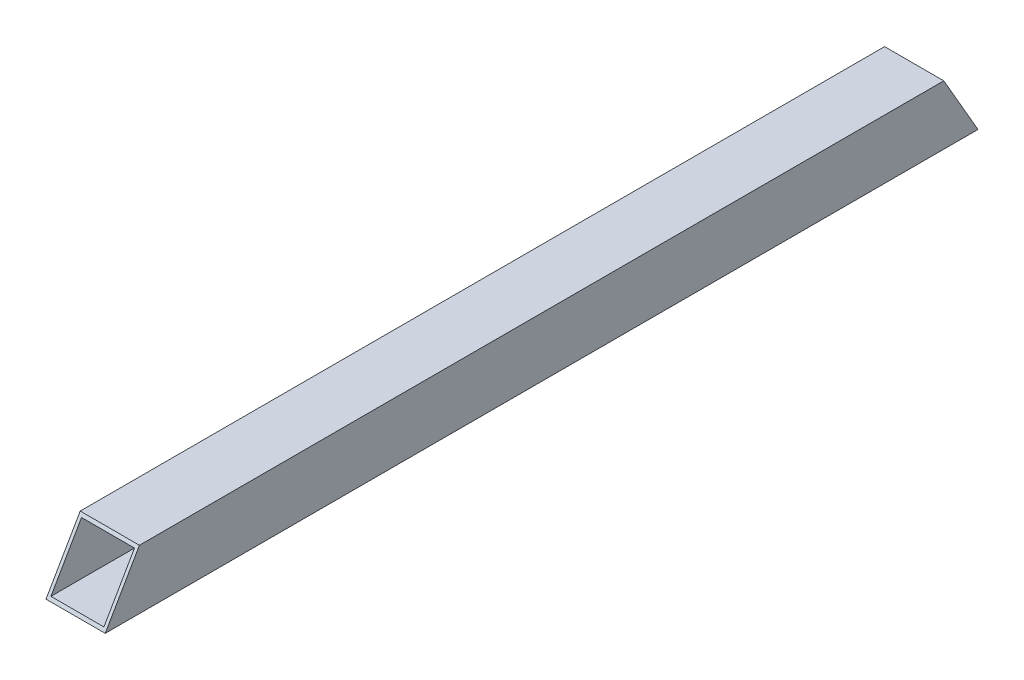
ISO-10303-21;
HEADER;
FILE_DESCRIPTION(('STEP AP214'),'2;1');
FILE_NAME('part.step','',(''),(''),'','','');
FILE_SCHEMA(('AUTOMOTIVE_DESIGN { 1 0 10303 214 1 1 1 1 }'));
ENDSEC;
DATA;
#1=APPLICATION_CONTEXT('core data for automotive mechanical design processes');
#2=APPLICATION_PROTOCOL_DEFINITION('international standard','automotive_design',2000,#1);
#3=PRODUCT_CONTEXT('',#1,'mechanical');
#4=PRODUCT('Part','Part','',(#3));
#5=PRODUCT_RELATED_PRODUCT_CATEGORY('part','',(#4));
#6=PRODUCT_DEFINITION_FORMATION('','',#4);
#7=PRODUCT_DEFINITION_CONTEXT('part definition',#1,'design');
#8=PRODUCT_DEFINITION('design','',#6,#7);
#9=PRODUCT_DEFINITION_SHAPE('','',#8);
#10=(LENGTH_UNIT() NAMED_UNIT(*) SI_UNIT(.MILLI.,.METRE.));
#11=(NAMED_UNIT(*) PLANE_ANGLE_UNIT() SI_UNIT($,.RADIAN.));
#12=(NAMED_UNIT(*) SI_UNIT($,.STERADIAN.) SOLID_ANGLE_UNIT());
#13=UNCERTAINTY_MEASURE_WITH_UNIT(LENGTH_MEASURE(1.E-05),#10,'distance_accuracy_value','');
#14=(GEOMETRIC_REPRESENTATION_CONTEXT(3) GLOBAL_UNCERTAINTY_ASSIGNED_CONTEXT((#13)) GLOBAL_UNIT_ASSIGNED_CONTEXT((#10,
#11,#12)) REPRESENTATION_CONTEXT('',''));
#15=CARTESIAN_POINT('',(0.,0.,0.));
#16=DIRECTION('',(0.,0.,1.));
#17=DIRECTION('',(1.,0.,0.));
#18=AXIS2_PLACEMENT_3D('',#15,#16,#17);
#19=CARTESIAN_POINT('',(9.5,-9.5,280.));
#20=DIRECTION('',(-1.,0.,0.));
#21=DIRECTION('',(0.,0.,1.));
#22=AXIS2_PLACEMENT_3D('',#19,#20,#21);
#23=PLANE('',#22);
#24=DIRECTION('',(0.,0.,-1.));
#25=VECTOR('',#24,1.);
#26=CARTESIAN_POINT('',(9.5,-9.5,280.));
#27=LINE('',#26,#25);
#28=CARTESIAN_POINT('',(9.50000000000001,-9.5,280.));
#29=VERTEX_POINT('',#28);
#30=CARTESIAN_POINT('',(9.5,-9.5,0.));
#31=VERTEX_POINT('',#30);
#32=EDGE_CURVE('E120',#29,#31,#27,.T.);
#33=ORIENTED_EDGE('',*,*,#32,.T.);
#34=DIRECTION('',(0.,0.866025403784436,0.500000000000004));
#35=VECTOR('',#34,1.);
#36=CARTESIAN_POINT('',(9.5,111.743556529822,70.0000000000012));
#37=LINE('',#36,#35);
#38=CARTESIAN_POINT('',(9.50000000000001,9.5,10.969655114603));
#39=VERTEX_POINT('',#38);
#40=EDGE_CURVE('E105',#31,#39,#37,.T.);
#41=ORIENTED_EDGE('',*,*,#40,.T.);
#42=DIRECTION('',(0.,0.,-1.));
#43=VECTOR('',#42,1.);
#44=CARTESIAN_POINT('',(9.5,9.5,280.));
#45=LINE('',#44,#43);
#46=CARTESIAN_POINT('',(9.5,9.5,269.030344885397));
#47=VERTEX_POINT('',#46);
#48=EDGE_CURVE('E43',#47,#39,#45,.T.);
#49=ORIENTED_EDGE('',*,*,#48,.F.);
#50=DIRECTION('',(0.,0.866025403784442,-0.499999999999995));
#51=VECTOR('',#50,1.);
#52=CARTESIAN_POINT('',(9.5,-9.5,280.));
#53=LINE('',#52,#51);
#54=EDGE_CURVE('E145',#29,#47,#53,.T.);
#55=ORIENTED_EDGE('',*,*,#54,.F.);
#56=EDGE_LOOP('',(#33,#41,#49,#55));
#57=FACE_BOUND('',#56,.T.);
#58=ADVANCED_FACE('F36',(#57),#23,.F.);
#59=CARTESIAN_POINT('',(-9.5,9.5,280.));
#60=DIRECTION('',(0.,-1.,0.));
#61=DIRECTION('',(0.,0.,-1.));
#62=AXIS2_PLACEMENT_3D('',#59,#60,#61);
#63=PLANE('',#62);
#64=ORIENTED_EDGE('',*,*,#48,.T.);
#65=DIRECTION('',(-1.,0.,0.));
#66=VECTOR('',#65,1.);
#67=CARTESIAN_POINT('',(361.107913733465,9.5,10.969655114603));
#68=LINE('',#67,#66);
#69=CARTESIAN_POINT('',(-9.50000000000001,9.5,10.969655114603));
#70=VERTEX_POINT('',#69);
#71=EDGE_CURVE('E102',#39,#70,#68,.T.);
#72=ORIENTED_EDGE('',*,*,#71,.T.);
#73=DIRECTION('',(0.,0.,-1.));
#74=VECTOR('',#73,1.);
#75=CARTESIAN_POINT('',(-9.5,9.5,280.));
#76=LINE('',#75,#74);
#77=CARTESIAN_POINT('',(-9.5,9.5,269.030344885397));
#78=VERTEX_POINT('',#77);
#79=EDGE_CURVE('E125',#78,#70,#76,.T.);
#80=ORIENTED_EDGE('',*,*,#79,.F.);
#81=DIRECTION('',(-1.,0.,0.));
#82=VECTOR('',#81,1.);
#83=CARTESIAN_POINT('',(361.107913733465,9.5,269.030344885397));
#84=LINE('',#83,#82);
#85=EDGE_CURVE('E121',#47,#78,#84,.T.);
#86=ORIENTED_EDGE('',*,*,#85,.F.);
#87=EDGE_LOOP('',(#64,#72,#80,#86));
#88=FACE_BOUND('',#87,.T.);
#89=ADVANCED_FACE('F123',(#88),#63,.F.);
#90=CARTESIAN_POINT('',(-9.5,-9.5,280.));
#91=DIRECTION('',(1.,0.,0.));
#92=DIRECTION('',(0.,0.,-1.));
#93=AXIS2_PLACEMENT_3D('',#90,#91,#92);
#94=PLANE('',#93);
#95=ORIENTED_EDGE('',*,*,#79,.T.);
#96=DIRECTION('',(0.,-0.866025403784436,-0.500000000000004));
#97=VECTOR('',#96,1.);
#98=CARTESIAN_POINT('',(-9.5,111.743556529822,70.0000000000012));
#99=LINE('',#98,#97);
#100=CARTESIAN_POINT('',(-9.50000000000001,-9.5,0.));
#101=VERTEX_POINT('',#100);
#102=EDGE_CURVE('E108',#70,#101,#99,.T.);
#103=ORIENTED_EDGE('',*,*,#102,.T.);
#104=DIRECTION('',(0.,0.,-1.));
#105=VECTOR('',#104,1.);
#106=CARTESIAN_POINT('',(-9.5,-9.5,280.));
#107=LINE('',#106,#105);
#108=CARTESIAN_POINT('',(-9.5,-9.5,280.));
#109=VERTEX_POINT('',#108);
#110=EDGE_CURVE('E126',#109,#101,#107,.T.);
#111=ORIENTED_EDGE('',*,*,#110,.F.);
#112=DIRECTION('',(0.,-0.866025403784442,0.499999999999995));
#113=VECTOR('',#112,1.);
#114=CARTESIAN_POINT('',(-9.5,-9.5,280.));
#115=LINE('',#114,#113);
#116=EDGE_CURVE('E147',#78,#109,#115,.T.);
#117=ORIENTED_EDGE('',*,*,#116,.F.);
#118=EDGE_LOOP('',(#95,#103,#111,#117));
#119=FACE_BOUND('',#118,.T.);
#120=ADVANCED_FACE('F181',(#119),#94,.F.);
#121=CARTESIAN_POINT('',(-8.5,-8.5,280.));
#122=DIRECTION('',(1.,0.,0.));
#123=DIRECTION('',(0.,0.,-1.));
#124=AXIS2_PLACEMENT_3D('',#121,#122,#123);
#125=PLANE('',#124);
#126=DIRECTION('',(0.,-0.866025403784436,-0.500000000000004));
#127=VECTOR('',#126,1.);
#128=CARTESIAN_POINT('',(-8.5,112.493556529822,70.4330127018934));
#129=LINE('',#128,#127);
#130=CARTESIAN_POINT('',(-8.5,8.5,10.3923048454134));
#131=VERTEX_POINT('',#130);
#132=CARTESIAN_POINT('',(-8.5,-8.5,0.577350269189592));
#133=VERTEX_POINT('',#132);
#134=EDGE_CURVE('E161',#131,#133,#129,.T.);
#135=ORIENTED_EDGE('',*,*,#134,.F.);
#136=DIRECTION('',(0.,0.,-1.));
#137=VECTOR('',#136,1.);
#138=CARTESIAN_POINT('',(-8.5,8.5,280.));
#139=LINE('',#138,#137);
#140=CARTESIAN_POINT('',(-8.5,8.5,269.607695154587));
#141=VERTEX_POINT('',#140);
#142=EDGE_CURVE('E143',#141,#131,#139,.T.);
#143=ORIENTED_EDGE('',*,*,#142,.F.);
#144=DIRECTION('',(0.,-0.866025403784442,0.499999999999995));
#145=VECTOR('',#144,1.);
#146=CARTESIAN_POINT('',(-8.5,-8.74999999999999,279.566987298108));
#147=LINE('',#146,#145);
#148=CARTESIAN_POINT('',(-8.5,-8.5,279.42264973081));
#149=VERTEX_POINT('',#148);
#150=EDGE_CURVE('E150',#141,#149,#147,.T.);
#151=ORIENTED_EDGE('',*,*,#150,.T.);
#152=DIRECTION('',(0.,0.,-1.));
#153=VECTOR('',#152,1.);
#154=CARTESIAN_POINT('',(-8.5,-8.5,280.));
#155=LINE('',#154,#153);
#156=EDGE_CURVE('E135',#149,#133,#155,.T.);
#157=ORIENTED_EDGE('',*,*,#156,.T.);
#158=EDGE_LOOP('',(#135,#143,#151,#157));
#159=FACE_BOUND('',#158,.T.);
#160=ADVANCED_FACE('F179',(#159),#125,.T.);
#161=CARTESIAN_POINT('',(-8.5,-8.5,280.));
#162=DIRECTION('',(0.,1.,0.));
#163=DIRECTION('',(0.,0.,1.));
#164=AXIS2_PLACEMENT_3D('',#161,#162,#163);
#165=PLANE('',#164);
#166=DIRECTION('',(1.,0.,0.));
#167=VECTOR('',#166,1.);
#168=CARTESIAN_POINT('',(-8.5,-8.5,0.577350269189592));
#169=LINE('',#168,#167);
#170=CARTESIAN_POINT('',(8.5,-8.50000000000001,0.577350269189592));
#171=VERTEX_POINT('',#170);
#172=EDGE_CURVE('E50',#133,#171,#169,.T.);
#173=ORIENTED_EDGE('',*,*,#172,.F.);
#174=ORIENTED_EDGE('',*,*,#156,.F.);
#175=DIRECTION('',(1.,0.,0.));
#176=VECTOR('',#175,1.);
#177=CARTESIAN_POINT('',(-8.5,-8.5,279.42264973081));
#178=LINE('',#177,#176);
#179=CARTESIAN_POINT('',(8.5,-8.5,279.42264973081));
#180=VERTEX_POINT('',#179);
#181=EDGE_CURVE('E153',#149,#180,#178,.T.);
#182=ORIENTED_EDGE('',*,*,#181,.T.);
#183=DIRECTION('',(0.,0.,-1.));
#184=VECTOR('',#183,1.);
#185=CARTESIAN_POINT('',(8.5,-8.5,280.));
#186=LINE('',#185,#184);
#187=EDGE_CURVE('E139',#180,#171,#186,.T.);
#188=ORIENTED_EDGE('',*,*,#187,.T.);
#189=EDGE_LOOP('',(#173,#174,#182,#188));
#190=FACE_BOUND('',#189,.T.);
#191=ADVANCED_FACE('F177',(#190),#165,.T.);
#192=CARTESIAN_POINT('',(8.5,-8.5,280.));
#193=DIRECTION('',(-1.,0.,0.));
#194=DIRECTION('',(0.,-1.,0.));
#195=AXIS2_PLACEMENT_3D('',#192,#193,#194);
#196=PLANE('',#195);
#197=DIRECTION('',(0.,0.866025403784436,0.500000000000004));
#198=VECTOR('',#197,1.);
#199=CARTESIAN_POINT('',(8.49999999999999,112.493556529822,70.4330127018934));
#200=LINE('',#199,#198);
#201=CARTESIAN_POINT('',(8.5,8.5,10.3923048454134));
#202=VERTEX_POINT('',#201);
#203=EDGE_CURVE('E58',#171,#202,#200,.T.);
#204=ORIENTED_EDGE('',*,*,#203,.F.);
#205=ORIENTED_EDGE('',*,*,#187,.F.);
#206=DIRECTION('',(0.,0.866025403784442,-0.499999999999995));
#207=VECTOR('',#206,1.);
#208=CARTESIAN_POINT('',(8.5,-8.74999999999999,279.566987298108));
#209=LINE('',#208,#207);
#210=CARTESIAN_POINT('',(8.5,8.5,269.607695154587));
#211=VERTEX_POINT('',#210);
#212=EDGE_CURVE('E156',#180,#211,#209,.T.);
#213=ORIENTED_EDGE('',*,*,#212,.T.);
#214=DIRECTION('',(0.,0.,-1.));
#215=VECTOR('',#214,1.);
#216=CARTESIAN_POINT('',(8.5,8.5,280.));
#217=LINE('',#216,#215);
#218=EDGE_CURVE('E141',#211,#202,#217,.T.);
#219=ORIENTED_EDGE('',*,*,#218,.T.);
#220=EDGE_LOOP('',(#204,#205,#213,#219));
#221=FACE_BOUND('',#220,.T.);
#222=ADVANCED_FACE('F173',(#221),#196,.T.);
#223=CARTESIAN_POINT('',(-8.5,8.5,280.));
#224=DIRECTION('',(0.,-1.,0.));
#225=DIRECTION('',(0.,0.,-1.));
#226=AXIS2_PLACEMENT_3D('',#223,#224,#225);
#227=PLANE('',#226);
#228=DIRECTION('',(-1.,0.,0.));
#229=VECTOR('',#228,1.);
#230=CARTESIAN_POINT('',(-8.5,8.5,10.3923048454134));
#231=LINE('',#230,#229);
#232=EDGE_CURVE('E113',#202,#131,#231,.T.);
#233=ORIENTED_EDGE('',*,*,#232,.F.);
#234=ORIENTED_EDGE('',*,*,#218,.F.);
#235=DIRECTION('',(-1.,0.,0.));
#236=VECTOR('',#235,1.);
#237=CARTESIAN_POINT('',(-8.5,8.5,269.607695154587));
#238=LINE('',#237,#236);
#239=EDGE_CURVE('E11',#211,#141,#238,.T.);
#240=ORIENTED_EDGE('',*,*,#239,.T.);
#241=ORIENTED_EDGE('',*,*,#142,.T.);
#242=EDGE_LOOP('',(#233,#234,#240,#241));
#243=FACE_BOUND('',#242,.T.);
#244=ADVANCED_FACE('F171',(#243),#227,.T.);
#245=CARTESIAN_POINT('',(-9.5,-9.5,280.));
#246=DIRECTION('',(0.,1.,0.));
#247=DIRECTION('',(0.,0.,1.));
#248=AXIS2_PLACEMENT_3D('',#245,#246,#247);
#249=PLANE('',#248);
#250=DIRECTION('',(1.,0.,0.));
#251=VECTOR('',#250,1.);
#252=CARTESIAN_POINT('',(-9.5,-9.5,0.));
#253=LINE('',#252,#251);
#254=EDGE_CURVE('E133',#101,#31,#253,.T.);
#255=ORIENTED_EDGE('',*,*,#254,.T.);
#256=ORIENTED_EDGE('',*,*,#32,.F.);
#257=DIRECTION('',(1.,0.,0.));
#258=VECTOR('',#257,1.);
#259=CARTESIAN_POINT('',(-9.5,-9.5,280.));
#260=LINE('',#259,#258);
#261=EDGE_CURVE('E132',#109,#29,#260,.T.);
#262=ORIENTED_EDGE('',*,*,#261,.F.);
#263=ORIENTED_EDGE('',*,*,#110,.T.);
#264=EDGE_LOOP('',(#255,#256,#262,#263));
#265=FACE_BOUND('',#264,.T.);
#266=ADVANCED_FACE('F197',(#265),#249,.F.);
#267=CARTESIAN_POINT('',(361.107913733465,-9.5,280.));
#268=DIRECTION('',(0.,0.499999999999995,0.866025403784441));
#269=DIRECTION('',(0.,-0.866025403784442,0.499999999999995));
#270=AXIS2_PLACEMENT_3D('',#267,#268,#269);
#271=PLANE('',#270);
#272=ORIENTED_EDGE('',*,*,#150,.F.);
#273=ORIENTED_EDGE('',*,*,#239,.F.);
#274=ORIENTED_EDGE('',*,*,#212,.F.);
#275=ORIENTED_EDGE('',*,*,#181,.F.);
#276=EDGE_LOOP('',(#272,#273,#274,#275));
#277=FACE_BOUND('',#276,.T.);
#278=ORIENTED_EDGE('',*,*,#261,.T.);
#279=ORIENTED_EDGE('',*,*,#54,.T.);
#280=ORIENTED_EDGE('',*,*,#85,.T.);
#281=ORIENTED_EDGE('',*,*,#116,.T.);
#282=EDGE_LOOP('',(#278,#279,#280,#281));
#283=FACE_BOUND('',#282,.T.);
#284=ADVANCED_FACE('F175',(#277,#283),#271,.T.);
#285=CARTESIAN_POINT('',(361.107913733465,-9.5,0.));
#286=DIRECTION('',(0.,-0.500000000000004,0.866025403784436));
#287=DIRECTION('',(0.,-0.866025403784436,-0.500000000000004));
#288=AXIS2_PLACEMENT_3D('',#285,#286,#287);
#289=PLANE('',#288);
#290=ORIENTED_EDGE('',*,*,#232,.T.);
#291=ORIENTED_EDGE('',*,*,#134,.T.);
#292=ORIENTED_EDGE('',*,*,#172,.T.);
#293=ORIENTED_EDGE('',*,*,#203,.T.);
#294=EDGE_LOOP('',(#290,#291,#292,#293));
#295=FACE_BOUND('',#294,.T.);
#296=ORIENTED_EDGE('',*,*,#40,.F.);
#297=ORIENTED_EDGE('',*,*,#254,.F.);
#298=ORIENTED_EDGE('',*,*,#102,.F.);
#299=ORIENTED_EDGE('',*,*,#71,.F.);
#300=EDGE_LOOP('',(#296,#297,#298,#299));
#301=FACE_BOUND('',#300,.T.);
#302=ADVANCED_FACE('F104',(#295,#301),#289,.F.);
#303=CLOSED_SHELL('',(#58,#89,#120,#160,#191,#222,#244,#266,#284,#302));
#304=MANIFOLD_SOLID_BREP('B2',#303);
#305=ADVANCED_BREP_SHAPE_REPRESENTATION('',(#18,#304),#14);
#306=SHAPE_DEFINITION_REPRESENTATION(#9,#305);
ENDSEC;
END-ISO-10303-21;
